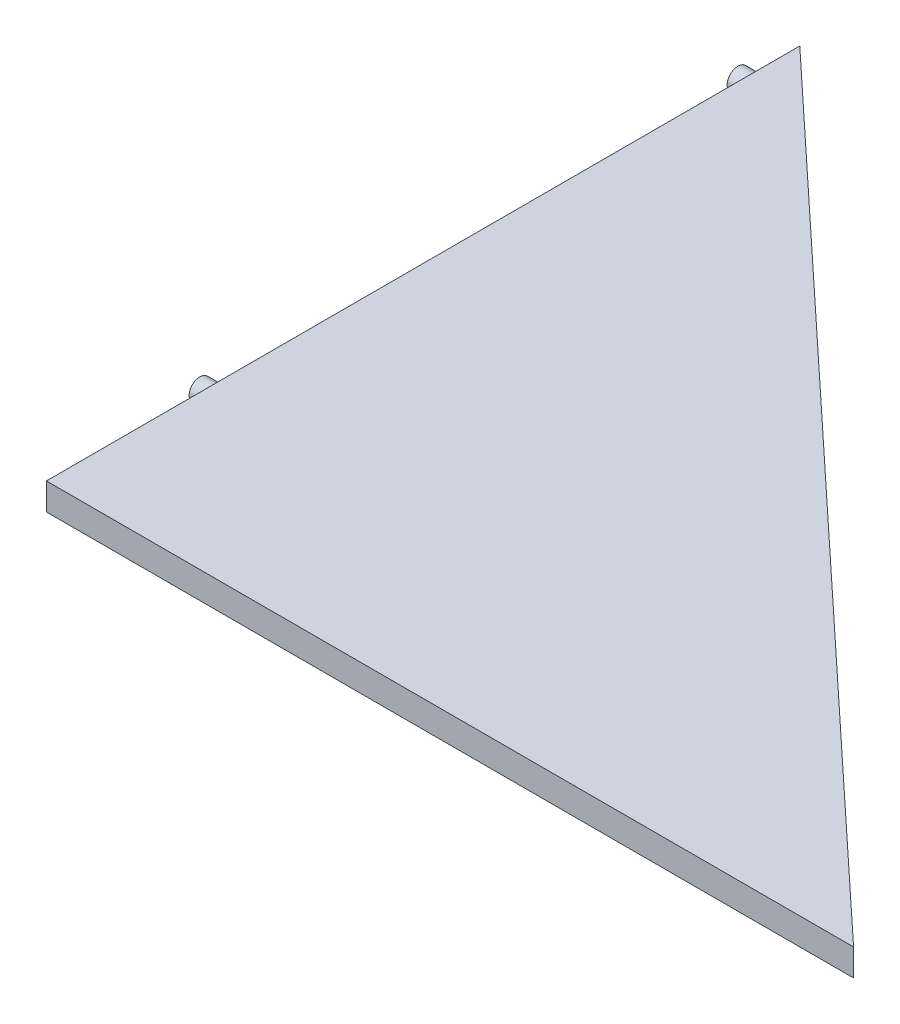
ISO-10303-21;
HEADER;
FILE_DESCRIPTION(('STEP AP214'),'2;1');
FILE_NAME('part.step','',(''),(''),'','','');
FILE_SCHEMA(('AUTOMOTIVE_DESIGN { 1 0 10303 214 1 1 1 1 }'));
ENDSEC;
DATA;
#1=APPLICATION_CONTEXT('core data for automotive mechanical design processes');
#2=APPLICATION_PROTOCOL_DEFINITION('international standard','automotive_design',2000,#1);
#3=PRODUCT_CONTEXT('',#1,'mechanical');
#4=PRODUCT('Part','Part','',(#3));
#5=PRODUCT_RELATED_PRODUCT_CATEGORY('part','',(#4));
#6=PRODUCT_DEFINITION_FORMATION('','',#4);
#7=PRODUCT_DEFINITION_CONTEXT('part definition',#1,'design');
#8=PRODUCT_DEFINITION('design','',#6,#7);
#9=PRODUCT_DEFINITION_SHAPE('','',#8);
#10=(LENGTH_UNIT() NAMED_UNIT(*) SI_UNIT(.MILLI.,.METRE.));
#11=(NAMED_UNIT(*) PLANE_ANGLE_UNIT() SI_UNIT($,.RADIAN.));
#12=(NAMED_UNIT(*) SI_UNIT($,.STERADIAN.) SOLID_ANGLE_UNIT());
#13=UNCERTAINTY_MEASURE_WITH_UNIT(LENGTH_MEASURE(1.E-05),#10,'distance_accuracy_value','');
#14=(GEOMETRIC_REPRESENTATION_CONTEXT(3) GLOBAL_UNCERTAINTY_ASSIGNED_CONTEXT((#13)) GLOBAL_UNIT_ASSIGNED_CONTEXT((#10,
#11,#12)) REPRESENTATION_CONTEXT('',''));
#15=CARTESIAN_POINT('',(0.,0.,0.));
#16=DIRECTION('',(0.,0.,1.));
#17=DIRECTION('',(1.,0.,0.));
#18=AXIS2_PLACEMENT_3D('',#15,#16,#17);
#19=CARTESIAN_POINT('',(-50.2637744272153,5.,93.0871438679324));
#20=DIRECTION('',(1.,0.,0.));
#21=DIRECTION('',(0.,0.,-1.));
#22=AXIS2_PLACEMENT_3D('',#19,#20,#21);
#23=PLANE('',#22);
#24=CARTESIAN_POINT('',(-50.2637744272153,2.5,61.5786131027091));
#25=DIRECTION('',(1.,0.,0.));
#26=DIRECTION('',(0.,0.,-1.));
#27=AXIS2_PLACEMENT_3D('',#24,#25,#26);
#28=CIRCLE('',#27,2.);
#29=CARTESIAN_POINT('',(-50.2637744272153,2.5,59.5786131027091));
#30=VERTEX_POINT('',#29);
#31=EDGE_CURVE('E11',#30,#30,#28,.F.);
#32=ORIENTED_EDGE('',*,*,#31,.F.);
#33=EDGE_LOOP('',(#32));
#34=FACE_BOUND('',#33,.T.);
#35=CARTESIAN_POINT('',(-50.2637744272153,2.5,-38.4213868972909));
#36=DIRECTION('',(1.,0.,0.));
#37=DIRECTION('',(0.,0.,-1.));
#38=AXIS2_PLACEMENT_3D('',#35,#36,#37);
#39=CIRCLE('',#38,2.);
#40=CARTESIAN_POINT('',(-50.2637744272153,2.5,-40.4213868972909));
#41=VERTEX_POINT('',#40);
#42=EDGE_CURVE('E46',#41,#41,#39,.F.);
#43=ORIENTED_EDGE('',*,*,#42,.F.);
#44=EDGE_LOOP('',(#43));
#45=FACE_BOUND('',#44,.T.);
#46=DIRECTION('',(0.,0.,1.));
#47=VECTOR('',#46,1.);
#48=CARTESIAN_POINT('',(-50.2637744272153,0.,93.0871438679324));
#49=LINE('',#48,#47);
#50=CARTESIAN_POINT('',(-50.2637744272153,0.,-46.9128561320676));
#51=VERTEX_POINT('',#50);
#52=CARTESIAN_POINT('',(-50.2637744272153,0.,93.0871438679324));
#53=VERTEX_POINT('',#52);
#54=EDGE_CURVE('E90',#51,#53,#49,.T.);
#55=ORIENTED_EDGE('',*,*,#54,.T.);
#56=DIRECTION('',(0.,-1.,0.));
#57=VECTOR('',#56,1.);
#58=CARTESIAN_POINT('',(-50.2637744272153,5.,93.0871438679324));
#59=LINE('',#58,#57);
#60=CARTESIAN_POINT('',(-50.2637744272153,5.,93.0871438679324));
#61=VERTEX_POINT('',#60);
#62=EDGE_CURVE('E78',#61,#53,#59,.T.);
#63=ORIENTED_EDGE('',*,*,#62,.F.);
#64=DIRECTION('',(0.,0.,1.));
#65=VECTOR('',#64,1.);
#66=CARTESIAN_POINT('',(-50.2637744272153,5.,93.0871438679324));
#67=LINE('',#66,#65);
#68=CARTESIAN_POINT('',(-50.2637744272153,5.,-46.9128561320676));
#69=VERTEX_POINT('',#68);
#70=EDGE_CURVE('E82',#69,#61,#67,.T.);
#71=ORIENTED_EDGE('',*,*,#70,.F.);
#72=DIRECTION('',(0.,-1.,0.));
#73=VECTOR('',#72,1.);
#74=CARTESIAN_POINT('',(-50.2637744272153,5.,-46.9128561320676));
#75=LINE('',#74,#73);
#76=EDGE_CURVE('E96',#69,#51,#75,.T.);
#77=ORIENTED_EDGE('',*,*,#76,.T.);
#78=EDGE_LOOP('',(#55,#63,#71,#77));
#79=FACE_BOUND('',#78,.T.);
#80=ADVANCED_FACE('F37',(#34,#45,#79),#23,.F.);
#81=CARTESIAN_POINT('',(-50.2637744272153,5.,93.0871438679324));
#82=DIRECTION('',(0.,0.,-1.));
#83=DIRECTION('',(-1.,0.,0.));
#84=AXIS2_PLACEMENT_3D('',#81,#82,#83);
#85=PLANE('',#84);
#86=DIRECTION('',(1.,0.,0.));
#87=VECTOR('',#86,1.);
#88=CARTESIAN_POINT('',(-50.2637744272153,0.,93.0871438679324));
#89=LINE('',#88,#87);
#90=CARTESIAN_POINT('',(99.7362255727846,0.,93.0871438679324));
#91=VERTEX_POINT('',#90);
#92=EDGE_CURVE('E67',#53,#91,#89,.T.);
#93=ORIENTED_EDGE('',*,*,#92,.T.);
#94=DIRECTION('',(0.,-1.,0.));
#95=VECTOR('',#94,1.);
#96=CARTESIAN_POINT('',(99.7362255727846,5.,93.0871438679324));
#97=LINE('',#96,#95);
#98=CARTESIAN_POINT('',(99.7362255727846,5.,93.0871438679324));
#99=VERTEX_POINT('',#98);
#100=EDGE_CURVE('E80',#99,#91,#97,.T.);
#101=ORIENTED_EDGE('',*,*,#100,.F.);
#102=DIRECTION('',(1.,0.,0.));
#103=VECTOR('',#102,1.);
#104=CARTESIAN_POINT('',(-50.2637744272153,5.,93.0871438679324));
#105=LINE('',#104,#103);
#106=EDGE_CURVE('E75',#61,#99,#105,.T.);
#107=ORIENTED_EDGE('',*,*,#106,.F.);
#108=ORIENTED_EDGE('',*,*,#62,.T.);
#109=EDGE_LOOP('',(#93,#101,#107,#108));
#110=FACE_BOUND('',#109,.T.);
#111=ADVANCED_FACE('F76',(#110),#85,.F.);
#112=CARTESIAN_POINT('',(-50.2637744272153,5.,-46.9128561320676));
#113=DIRECTION('',(-0.682318250360011,0.,0.731055268242869));
#114=DIRECTION('',(0.731055268242869,0.,0.682318250360011));
#115=AXIS2_PLACEMENT_3D('',#112,#113,#114);
#116=PLANE('',#115);
#117=DIRECTION('',(-0.731055268242869,0.,-0.682318250360011));
#118=VECTOR('',#117,1.);
#119=CARTESIAN_POINT('',(-50.2637744272153,0.,-46.9128561320676));
#120=LINE('',#119,#118);
#121=EDGE_CURVE('E72',#91,#51,#120,.T.);
#122=ORIENTED_EDGE('',*,*,#121,.T.);
#123=ORIENTED_EDGE('',*,*,#76,.F.);
#124=DIRECTION('',(-0.731055268242869,0.,-0.682318250360011));
#125=VECTOR('',#124,1.);
#126=CARTESIAN_POINT('',(-50.2637744272153,5.,-46.9128561320676));
#127=LINE('',#126,#125);
#128=EDGE_CURVE('E54',#99,#69,#127,.T.);
#129=ORIENTED_EDGE('',*,*,#128,.F.);
#130=ORIENTED_EDGE('',*,*,#100,.T.);
#131=EDGE_LOOP('',(#122,#123,#129,#130));
#132=FACE_BOUND('',#131,.T.);
#133=ADVANCED_FACE('F147',(#132),#116,.F.);
#134=CARTESIAN_POINT('',(0.,5.,0.));
#135=DIRECTION('',(0.,-1.,0.));
#136=DIRECTION('',(0.,0.,-1.));
#137=AXIS2_PLACEMENT_3D('',#134,#135,#136);
#138=PLANE('',#137);
#139=ORIENTED_EDGE('',*,*,#70,.T.);
#140=ORIENTED_EDGE('',*,*,#106,.T.);
#141=ORIENTED_EDGE('',*,*,#128,.T.);
#142=EDGE_LOOP('',(#139,#140,#141));
#143=FACE_BOUND('',#142,.T.);
#144=ADVANCED_FACE('F85',(#143),#138,.F.);
#145=CARTESIAN_POINT('',(0.,0.,0.));
#146=DIRECTION('',(0.,-1.,0.));
#147=DIRECTION('',(0.,0.,-1.));
#148=AXIS2_PLACEMENT_3D('',#145,#146,#147);
#149=PLANE('',#148);
#150=ORIENTED_EDGE('',*,*,#54,.F.);
#151=ORIENTED_EDGE('',*,*,#121,.F.);
#152=ORIENTED_EDGE('',*,*,#92,.F.);
#153=EDGE_LOOP('',(#150,#151,#152));
#154=FACE_BOUND('',#153,.T.);
#155=ADVANCED_FACE('F133',(#154),#149,.T.);
#156=CARTESIAN_POINT('',(-53.2637744272153,2.5,-38.4213868972909));
#157=DIRECTION('',(1.,0.,0.));
#158=DIRECTION('',(0.,0.,-1.));
#159=AXIS2_PLACEMENT_3D('',#156,#157,#158);
#160=CYLINDRICAL_SURFACE('',#159,2.);
#161=CARTESIAN_POINT('',(-53.2637744272153,2.5,-38.4213868972909));
#162=DIRECTION('',(-1.,0.,0.));
#163=DIRECTION('',(0.,0.,1.));
#164=AXIS2_PLACEMENT_3D('',#161,#162,#163);
#165=CIRCLE('',#164,2.);
#166=CARTESIAN_POINT('',(-53.2637744272153,2.5,-36.4213868972909));
#167=VERTEX_POINT('',#166);
#168=EDGE_CURVE('E107',#167,#167,#165,.T.);
#169=ORIENTED_EDGE('',*,*,#168,.F.);
#170=EDGE_LOOP('',(#169));
#171=FACE_BOUND('',#170,.T.);
#172=ORIENTED_EDGE('',*,*,#42,.T.);
#173=EDGE_LOOP('',(#172));
#174=FACE_BOUND('',#173,.T.);
#175=ADVANCED_FACE('F131',(#171,#174),#160,.T.);
#176=CARTESIAN_POINT('',(-53.2637744272153,2.5,-38.4213868972909));
#177=DIRECTION('',(-1.,0.,0.));
#178=DIRECTION('',(0.,0.,1.));
#179=AXIS2_PLACEMENT_3D('',#176,#177,#178);
#180=PLANE('',#179);
#181=ORIENTED_EDGE('',*,*,#168,.T.);
#182=EDGE_LOOP('',(#181));
#183=FACE_BOUND('',#182,.T.);
#184=ADVANCED_FACE('F123',(#183),#180,.T.);
#185=CARTESIAN_POINT('',(-53.2637744272153,2.5,61.5786131027091));
#186=DIRECTION('',(1.,0.,0.));
#187=DIRECTION('',(0.,0.,-1.));
#188=AXIS2_PLACEMENT_3D('',#185,#186,#187);
#189=CYLINDRICAL_SURFACE('',#188,2.);
#190=CARTESIAN_POINT('',(-53.2637744272153,2.5,61.5786131027091));
#191=DIRECTION('',(-1.,0.,0.));
#192=DIRECTION('',(0.,0.,1.));
#193=AXIS2_PLACEMENT_3D('',#190,#191,#192);
#194=CIRCLE('',#193,2.);
#195=CARTESIAN_POINT('',(-53.2637744272153,2.5,63.5786131027091));
#196=VERTEX_POINT('',#195);
#197=EDGE_CURVE('E113',#196,#196,#194,.T.);
#198=ORIENTED_EDGE('',*,*,#197,.F.);
#199=EDGE_LOOP('',(#198));
#200=FACE_BOUND('',#199,.T.);
#201=ORIENTED_EDGE('',*,*,#31,.T.);
#202=EDGE_LOOP('',(#201));
#203=FACE_BOUND('',#202,.T.);
#204=ADVANCED_FACE('F120',(#200,#203),#189,.T.);
#205=CARTESIAN_POINT('',(-53.2637744272153,2.5,61.5786131027091));
#206=DIRECTION('',(-1.,0.,0.));
#207=DIRECTION('',(0.,0.,1.));
#208=AXIS2_PLACEMENT_3D('',#205,#206,#207);
#209=PLANE('',#208);
#210=ORIENTED_EDGE('',*,*,#197,.T.);
#211=EDGE_LOOP('',(#210));
#212=FACE_BOUND('',#211,.T.);
#213=ADVANCED_FACE('F118',(#212),#209,.T.);
#214=CLOSED_SHELL('',(#80,#111,#133,#144,#155,#175,#184,#204,#213));
#215=MANIFOLD_SOLID_BREP('B2',#214);
#216=ADVANCED_BREP_SHAPE_REPRESENTATION('',(#18,#215),#14);
#217=SHAPE_DEFINITION_REPRESENTATION(#9,#216);
ENDSEC;
END-ISO-10303-21;
